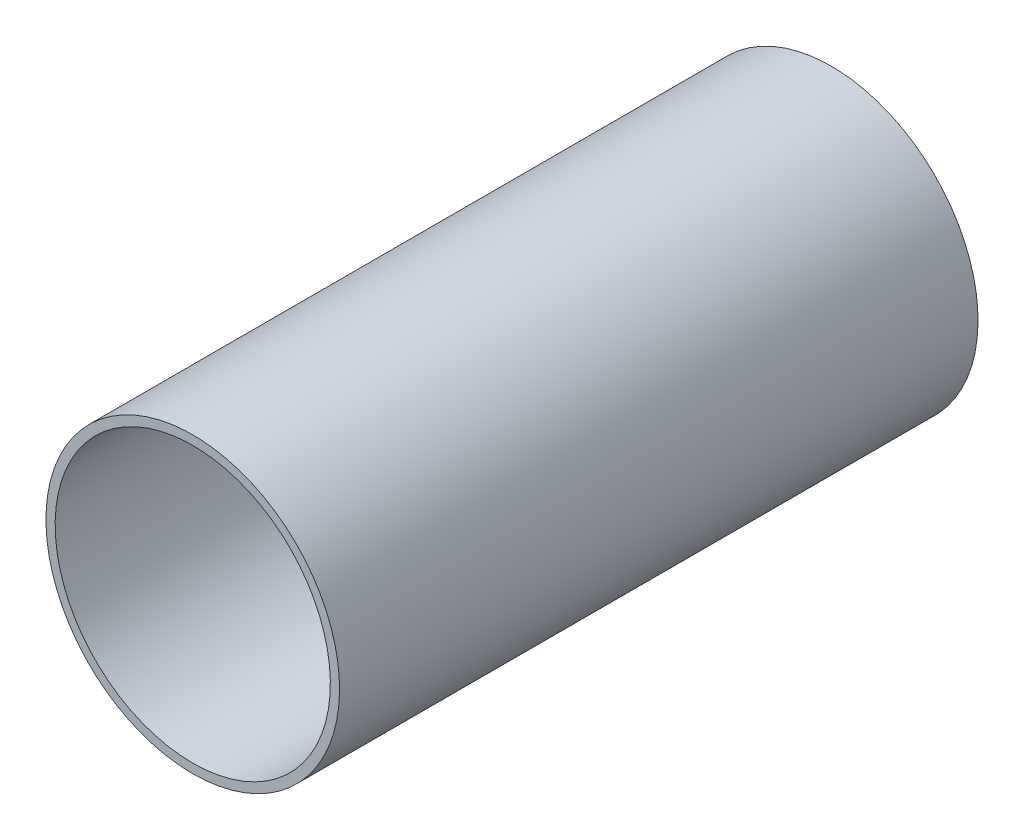
ISO-10303-21;
HEADER;
FILE_DESCRIPTION(('STEP AP214'),'2;1');
FILE_NAME('part.step','',(''),(''),'','','');
FILE_SCHEMA(('AUTOMOTIVE_DESIGN { 1 0 10303 214 1 1 1 1 }'));
ENDSEC;
DATA;
#1=APPLICATION_CONTEXT('core data for automotive mechanical design processes');
#2=APPLICATION_PROTOCOL_DEFINITION('international standard','automotive_design',2000,#1);
#3=PRODUCT_CONTEXT('',#1,'mechanical');
#4=PRODUCT('Part','Part','',(#3));
#5=PRODUCT_RELATED_PRODUCT_CATEGORY('part','',(#4));
#6=PRODUCT_DEFINITION_FORMATION('','',#4);
#7=PRODUCT_DEFINITION_CONTEXT('part definition',#1,'design');
#8=PRODUCT_DEFINITION('design','',#6,#7);
#9=PRODUCT_DEFINITION_SHAPE('','',#8);
#10=(LENGTH_UNIT() NAMED_UNIT(*) SI_UNIT(.MILLI.,.METRE.));
#11=(NAMED_UNIT(*) PLANE_ANGLE_UNIT() SI_UNIT($,.RADIAN.));
#12=(NAMED_UNIT(*) SI_UNIT($,.STERADIAN.) SOLID_ANGLE_UNIT());
#13=UNCERTAINTY_MEASURE_WITH_UNIT(LENGTH_MEASURE(1.E-05),#10,'distance_accuracy_value','');
#14=(GEOMETRIC_REPRESENTATION_CONTEXT(3) GLOBAL_UNCERTAINTY_ASSIGNED_CONTEXT((#13)) GLOBAL_UNIT_ASSIGNED_CONTEXT((#10,
#11,#12)) REPRESENTATION_CONTEXT('',''));
#15=CARTESIAN_POINT('',(0.,0.,0.));
#16=DIRECTION('',(0.,0.,1.));
#17=DIRECTION('',(1.,0.,0.));
#18=AXIS2_PLACEMENT_3D('',#15,#16,#17);
#19=CARTESIAN_POINT('',(121.92,-80.772,-0.045));
#20=DIRECTION('',(0.,0.,-1.));
#21=DIRECTION('',(0.,-1.,0.));
#22=AXIS2_PLACEMENT_3D('',#19,#20,#21);
#23=CYLINDRICAL_SURFACE('',#22,0.375);
#24=CARTESIAN_POINT('',(121.92,-80.772,-0.035));
#25=DIRECTION('',(0.,0.,-1.));
#26=DIRECTION('',(0.,-1.,0.));
#27=AXIS2_PLACEMENT_3D('',#24,#25,#26);
#28=CIRCLE('',#27,0.375);
#29=CARTESIAN_POINT('',(121.92,-81.147,-0.035));
#30=VERTEX_POINT('',#29);
#31=EDGE_CURVE('E54',#30,#30,#28,.T.);
#32=ORIENTED_EDGE('',*,*,#31,.T.);
#33=DIRECTION('',(0.,0.,1.));
#34=VECTOR('',#33,1.);
#35=CARTESIAN_POINT('',(121.92,-81.147,-0.045));
#36=LINE('',#35,#34);
#37=CARTESIAN_POINT('',(121.92,-81.147,1.705));
#38=VERTEX_POINT('',#37);
#39=EDGE_CURVE('E11',#30,#38,#36,.T.);
#40=ORIENTED_EDGE('',*,*,#39,.T.);
#41=CARTESIAN_POINT('',(121.92,-80.772,1.705));
#42=DIRECTION('',(0.,0.,-1.));
#43=DIRECTION('',(0.,-1.,0.));
#44=AXIS2_PLACEMENT_3D('',#41,#42,#43);
#45=CIRCLE('',#44,0.375);
#46=EDGE_CURVE('E20',#38,#38,#45,.T.);
#47=ORIENTED_EDGE('',*,*,#46,.F.);
#48=ORIENTED_EDGE('',*,*,#39,.F.);
#49=EDGE_LOOP('',(#32,#40,#47,#48));
#50=FACE_BOUND('',#49,.T.);
#51=ADVANCED_FACE('F17',(#50),#23,.F.);
#52=CARTESIAN_POINT('',(121.92,-81.172,1.705));
#53=DIRECTION('',(0.,0.,1.));
#54=DIRECTION('',(1.,0.,0.));
#55=AXIS2_PLACEMENT_3D('',#52,#53,#54);
#56=PLANE('',#55);
#57=ORIENTED_EDGE('',*,*,#46,.T.);
#58=EDGE_LOOP('',(#57));
#59=FACE_BOUND('',#58,.T.);
#60=CARTESIAN_POINT('',(121.92,-80.772,1.705));
#61=DIRECTION('',(0.,0.,1.));
#62=DIRECTION('',(0.,-1.,0.));
#63=AXIS2_PLACEMENT_3D('',#60,#61,#62);
#64=CIRCLE('',#63,0.4);
#65=CARTESIAN_POINT('',(121.92,-81.172,1.705));
#66=VERTEX_POINT('',#65);
#67=EDGE_CURVE('E49',#66,#66,#64,.T.);
#68=ORIENTED_EDGE('',*,*,#67,.T.);
#69=EDGE_LOOP('',(#68));
#70=FACE_BOUND('',#69,.T.);
#71=ADVANCED_FACE('F50',(#59,#70),#56,.T.);
#72=CARTESIAN_POINT('',(121.92,-81.172,-0.035));
#73=DIRECTION('',(0.,0.,1.));
#74=DIRECTION('',(1.,0.,0.));
#75=AXIS2_PLACEMENT_3D('',#72,#73,#74);
#76=PLANE('',#75);
#77=ORIENTED_EDGE('',*,*,#31,.F.);
#78=EDGE_LOOP('',(#77));
#79=FACE_BOUND('',#78,.T.);
#80=CARTESIAN_POINT('',(121.92,-80.772,-0.035));
#81=DIRECTION('',(0.,0.,1.));
#82=DIRECTION('',(0.,-1.,0.));
#83=AXIS2_PLACEMENT_3D('',#80,#81,#82);
#84=CIRCLE('',#83,0.4);
#85=CARTESIAN_POINT('',(121.92,-81.172,-0.035));
#86=VERTEX_POINT('',#85);
#87=EDGE_CURVE('E62',#86,#86,#84,.T.);
#88=ORIENTED_EDGE('',*,*,#87,.F.);
#89=EDGE_LOOP('',(#88));
#90=FACE_BOUND('',#89,.T.);
#91=ADVANCED_FACE('F72',(#79,#90),#76,.F.);
#92=CARTESIAN_POINT('',(121.92,-80.772,-0.035));
#93=DIRECTION('',(0.,0.,-1.));
#94=DIRECTION('',(0.,-1.,0.));
#95=AXIS2_PLACEMENT_3D('',#92,#93,#94);
#96=CYLINDRICAL_SURFACE('',#95,0.4);
#97=ORIENTED_EDGE('',*,*,#87,.T.);
#98=DIRECTION('',(0.,0.,1.));
#99=VECTOR('',#98,1.);
#100=CARTESIAN_POINT('',(121.92,-81.172,-0.035));
#101=LINE('',#100,#99);
#102=EDGE_CURVE('E55',#86,#66,#101,.T.);
#103=ORIENTED_EDGE('',*,*,#102,.T.);
#104=ORIENTED_EDGE('',*,*,#67,.F.);
#105=ORIENTED_EDGE('',*,*,#102,.F.);
#106=EDGE_LOOP('',(#97,#103,#104,#105));
#107=FACE_BOUND('',#106,.T.);
#108=ADVANCED_FACE('F70',(#107),#96,.T.);
#109=CLOSED_SHELL('',(#51,#71,#91,#108));
#110=MANIFOLD_SOLID_BREP('B1',#109);
#111=ADVANCED_BREP_SHAPE_REPRESENTATION('',(#18,#110),#14);
#112=SHAPE_DEFINITION_REPRESENTATION(#9,#111);
ENDSEC;
END-ISO-10303-21;
